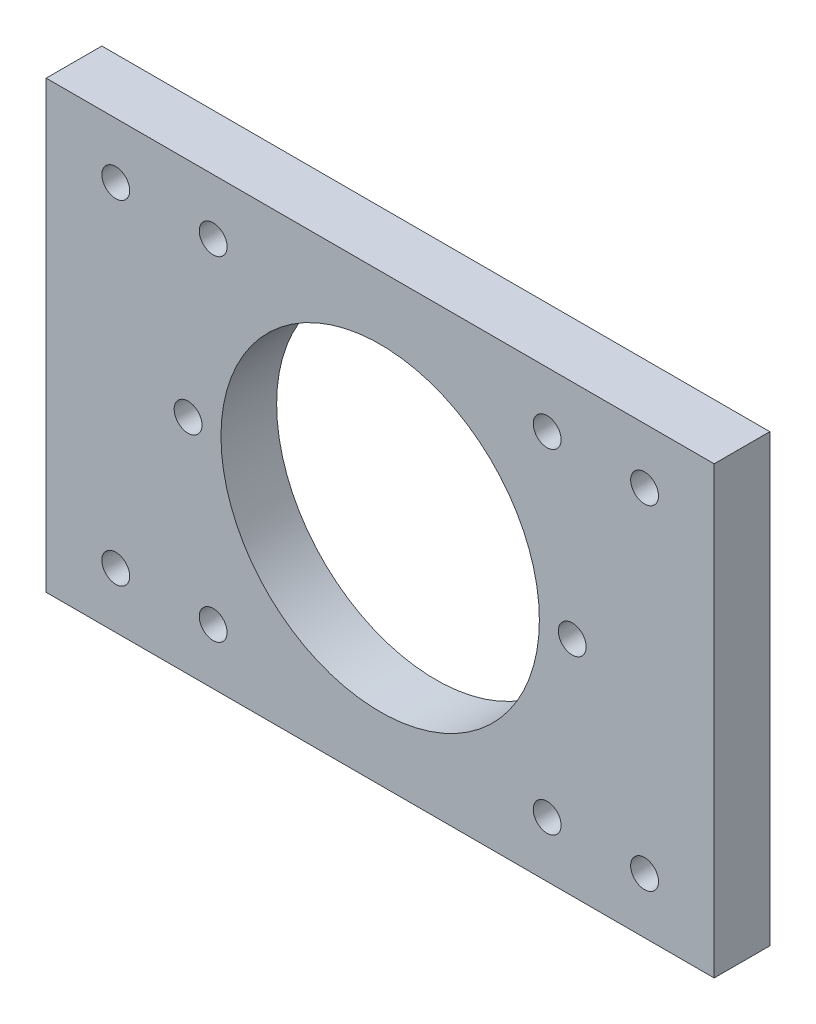
ISO-10303-21;
HEADER;
FILE_DESCRIPTION(('STEP AP214'),'2;1');
FILE_NAME('part.step','',(''),(''),'','','');
FILE_SCHEMA(('AUTOMOTIVE_DESIGN { 1 0 10303 214 1 1 1 1 }'));
ENDSEC;
DATA;
#1=APPLICATION_CONTEXT('core data for automotive mechanical design processes');
#2=APPLICATION_PROTOCOL_DEFINITION('international standard','automotive_design',2000,#1);
#3=PRODUCT_CONTEXT('',#1,'mechanical');
#4=PRODUCT('Part','Part','',(#3));
#5=PRODUCT_RELATED_PRODUCT_CATEGORY('part','',(#4));
#6=PRODUCT_DEFINITION_FORMATION('','',#4);
#7=PRODUCT_DEFINITION_CONTEXT('part definition',#1,'design');
#8=PRODUCT_DEFINITION('design','',#6,#7);
#9=PRODUCT_DEFINITION_SHAPE('','',#8);
#10=(LENGTH_UNIT() NAMED_UNIT(*) SI_UNIT(.MILLI.,.METRE.));
#11=(NAMED_UNIT(*) PLANE_ANGLE_UNIT() SI_UNIT($,.RADIAN.));
#12=(NAMED_UNIT(*) SI_UNIT($,.STERADIAN.) SOLID_ANGLE_UNIT());
#13=UNCERTAINTY_MEASURE_WITH_UNIT(LENGTH_MEASURE(1.E-05),#10,'distance_accuracy_value','');
#14=(GEOMETRIC_REPRESENTATION_CONTEXT(3) GLOBAL_UNCERTAINTY_ASSIGNED_CONTEXT((#13)) GLOBAL_UNIT_ASSIGNED_CONTEXT((#10,
#11,#12)) REPRESENTATION_CONTEXT('',''));
#15=CARTESIAN_POINT('',(0.,0.,0.));
#16=DIRECTION('',(0.,0.,1.));
#17=DIRECTION('',(1.,0.,0.));
#18=AXIS2_PLACEMENT_3D('',#15,#16,#17);
#19=CARTESIAN_POINT('',(0.,50.8,6.35));
#20=DIRECTION('',(0.,0.,-1.));
#21=DIRECTION('',(-1.,0.,0.));
#22=AXIS2_PLACEMENT_3D('',#19,#20,#21);
#23=PLANE('',#22);
#24=CARTESIAN_POINT('',(19.0500000000001,6.35000000000006,6.35));
#25=DIRECTION('',(0.,0.,-1.));
#26=DIRECTION('',(-1.,0.,0.));
#27=AXIS2_PLACEMENT_3D('',#24,#25,#26);
#28=CIRCLE('',#27,1.5875);
#29=CARTESIAN_POINT('',(17.4625000000001,6.35000000000006,6.35));
#30=VERTEX_POINT('',#29);
#31=EDGE_CURVE('E344',#30,#30,#28,.T.);
#32=ORIENTED_EDGE('',*,*,#31,.T.);
#33=EDGE_LOOP('',(#32));
#34=FACE_BOUND('',#33,.T.);
#35=CARTESIAN_POINT('',(57.1499999999999,6.34999999999994,6.35));
#36=DIRECTION('',(0.,0.,-1.));
#37=DIRECTION('',(-1.,0.,0.));
#38=AXIS2_PLACEMENT_3D('',#35,#36,#37);
#39=CIRCLE('',#38,1.5875);
#40=CARTESIAN_POINT('',(55.5624999999999,6.34999999999994,6.35));
#41=VERTEX_POINT('',#40);
#42=EDGE_CURVE('E352',#41,#41,#39,.T.);
#43=ORIENTED_EDGE('',*,*,#42,.T.);
#44=EDGE_LOOP('',(#43));
#45=FACE_BOUND('',#44,.T.);
#46=CARTESIAN_POINT('',(57.1499999999993,44.4499999999998,6.35));
#47=DIRECTION('',(0.,0.,-1.));
#48=DIRECTION('',(-1.,0.,0.));
#49=AXIS2_PLACEMENT_3D('',#46,#47,#48);
#50=CIRCLE('',#49,1.5875);
#51=CARTESIAN_POINT('',(55.5624999999993,44.4499999999998,6.35));
#52=VERTEX_POINT('',#51);
#53=EDGE_CURVE('E358',#52,#52,#50,.T.);
#54=ORIENTED_EDGE('',*,*,#53,.T.);
#55=EDGE_LOOP('',(#54));
#56=FACE_BOUND('',#55,.T.);
#57=CARTESIAN_POINT('',(19.0499999999999,44.45,6.35));
#58=DIRECTION('',(0.,0.,-1.));
#59=DIRECTION('',(-1.,0.,0.));
#60=AXIS2_PLACEMENT_3D('',#57,#58,#59);
#61=CIRCLE('',#60,1.5875);
#62=CARTESIAN_POINT('',(17.4624999999999,44.45,6.35));
#63=VERTEX_POINT('',#62);
#64=EDGE_CURVE('E135',#63,#63,#61,.T.);
#65=ORIENTED_EDGE('',*,*,#64,.T.);
#66=EDGE_LOOP('',(#65));
#67=FACE_BOUND('',#66,.T.);
#68=CARTESIAN_POINT('',(7.93750000000001,44.45,6.35));
#69=DIRECTION('',(0.,0.,1.));
#70=DIRECTION('',(1.,0.,0.));
#71=AXIS2_PLACEMENT_3D('',#68,#69,#70);
#72=CIRCLE('',#71,1.5875);
#73=CARTESIAN_POINT('',(9.52500000000001,44.45,6.35));
#74=VERTEX_POINT('',#73);
#75=EDGE_CURVE('E149',#74,#74,#72,.T.);
#76=ORIENTED_EDGE('',*,*,#75,.F.);
#77=EDGE_LOOP('',(#76));
#78=FACE_BOUND('',#77,.T.);
#79=CARTESIAN_POINT('',(68.2625,44.45,6.35));
#80=DIRECTION('',(0.,0.,-1.));
#81=DIRECTION('',(-1.,0.,0.));
#82=AXIS2_PLACEMENT_3D('',#79,#80,#81);
#83=CIRCLE('',#82,1.5875);
#84=CARTESIAN_POINT('',(66.675,44.45,6.35));
#85=VERTEX_POINT('',#84);
#86=EDGE_CURVE('E155',#85,#85,#83,.T.);
#87=ORIENTED_EDGE('',*,*,#86,.T.);
#88=EDGE_LOOP('',(#87));
#89=FACE_BOUND('',#88,.T.);
#90=CARTESIAN_POINT('',(16.1881750645913,25.4,6.35));
#91=DIRECTION('',(0.,0.,-1.));
#92=DIRECTION('',(-1.,0.,0.));
#93=AXIS2_PLACEMENT_3D('',#90,#91,#92);
#94=CIRCLE('',#93,1.5875);
#95=CARTESIAN_POINT('',(14.6006750645913,25.4,6.35));
#96=VERTEX_POINT('',#95);
#97=EDGE_CURVE('E165',#96,#96,#94,.F.);
#98=ORIENTED_EDGE('',*,*,#97,.F.);
#99=EDGE_LOOP('',(#98));
#100=FACE_BOUND('',#99,.T.);
#101=DIRECTION('',(0.,-1.,0.));
#102=VECTOR('',#101,1.);
#103=CARTESIAN_POINT('',(0.,0.,6.35));
#104=LINE('',#103,#102);
#105=CARTESIAN_POINT('',(0.,50.8,6.35));
#106=VERTEX_POINT('',#105);
#107=CARTESIAN_POINT('',(0.,0.,6.35));
#108=VERTEX_POINT('',#107);
#109=EDGE_CURVE('E88',#106,#108,#104,.T.);
#110=ORIENTED_EDGE('',*,*,#109,.T.);
#111=DIRECTION('',(1.,0.,0.));
#112=VECTOR('',#111,1.);
#113=CARTESIAN_POINT('',(0.,0.,6.35));
#114=LINE('',#113,#112);
#115=CARTESIAN_POINT('',(76.2,0.,6.35));
#116=VERTEX_POINT('',#115);
#117=EDGE_CURVE('E83',#108,#116,#114,.T.);
#118=ORIENTED_EDGE('',*,*,#117,.T.);
#119=DIRECTION('',(0.,1.,0.));
#120=VECTOR('',#119,1.);
#121=CARTESIAN_POINT('',(76.2,0.,6.35));
#122=LINE('',#121,#120);
#123=CARTESIAN_POINT('',(76.2,50.8,6.35));
#124=VERTEX_POINT('',#123);
#125=EDGE_CURVE('E86',#116,#124,#122,.T.);
#126=ORIENTED_EDGE('',*,*,#125,.T.);
#127=DIRECTION('',(-1.,0.,0.));
#128=VECTOR('',#127,1.);
#129=CARTESIAN_POINT('',(0.,50.8,6.35));
#130=LINE('',#129,#128);
#131=EDGE_CURVE('E52',#124,#106,#130,.T.);
#132=ORIENTED_EDGE('',*,*,#131,.T.);
#133=EDGE_LOOP('',(#110,#118,#126,#132));
#134=FACE_BOUND('',#133,.T.);
#135=CARTESIAN_POINT('',(38.1,25.4,6.35));
#136=DIRECTION('',(0.,0.,-1.));
#137=DIRECTION('',(-1.,0.,0.));
#138=AXIS2_PLACEMENT_3D('',#135,#136,#137);
#139=CIRCLE('',#138,18.161);
#140=CARTESIAN_POINT('',(19.939,25.4,6.35));
#141=VERTEX_POINT('',#140);
#142=EDGE_CURVE('E162',#141,#141,#139,.F.);
#143=ORIENTED_EDGE('',*,*,#142,.F.);
#144=EDGE_LOOP('',(#143));
#145=FACE_BOUND('',#144,.T.);
#146=CARTESIAN_POINT('',(60.0118249354087,25.4,6.35));
#147=DIRECTION('',(0.,0.,-1.));
#148=DIRECTION('',(-1.,0.,0.));
#149=AXIS2_PLACEMENT_3D('',#146,#147,#148);
#150=CIRCLE('',#149,1.5875);
#151=CARTESIAN_POINT('',(58.4243249354087,25.4,6.35));
#152=VERTEX_POINT('',#151);
#153=EDGE_CURVE('E105',#152,#152,#150,.F.);
#154=ORIENTED_EDGE('',*,*,#153,.F.);
#155=EDGE_LOOP('',(#154));
#156=FACE_BOUND('',#155,.T.);
#157=CARTESIAN_POINT('',(7.9375,6.35,6.35));
#158=DIRECTION('',(0.,0.,-1.));
#159=DIRECTION('',(1.,0.,0.));
#160=AXIS2_PLACEMENT_3D('',#157,#158,#159);
#161=CIRCLE('',#160,1.5875);
#162=CARTESIAN_POINT('',(9.525,6.35,6.35));
#163=VERTEX_POINT('',#162);
#164=EDGE_CURVE('E144',#163,#163,#161,.T.);
#165=ORIENTED_EDGE('',*,*,#164,.T.);
#166=EDGE_LOOP('',(#165));
#167=FACE_BOUND('',#166,.T.);
#168=CARTESIAN_POINT('',(68.2625,6.35,6.35));
#169=DIRECTION('',(0.,0.,1.));
#170=DIRECTION('',(-1.,0.,0.));
#171=AXIS2_PLACEMENT_3D('',#168,#169,#170);
#172=CIRCLE('',#171,1.5875);
#173=CARTESIAN_POINT('',(66.675,6.35,6.35));
#174=VERTEX_POINT('',#173);
#175=EDGE_CURVE('E134',#174,#174,#172,.T.);
#176=ORIENTED_EDGE('',*,*,#175,.F.);
#177=EDGE_LOOP('',(#176));
#178=FACE_BOUND('',#177,.T.);
#179=ADVANCED_FACE('F35',(#34,#45,#56,#67,#78,#89,#100,#134,#145,#156,#167,#178),#23,.F.);
#180=CARTESIAN_POINT('',(0.,50.8,0.));
#181=DIRECTION('',(0.,0.,-1.));
#182=DIRECTION('',(-1.,0.,0.));
#183=AXIS2_PLACEMENT_3D('',#180,#181,#182);
#184=PLANE('',#183);
#185=CARTESIAN_POINT('',(19.0500000000001,6.35000000000006,0.));
#186=DIRECTION('',(0.,0.,-1.));
#187=DIRECTION('',(-1.,0.,0.));
#188=AXIS2_PLACEMENT_3D('',#185,#186,#187);
#189=CIRCLE('',#188,1.5875);
#190=CARTESIAN_POINT('',(17.4625000000001,6.35000000000006,0.));
#191=VERTEX_POINT('',#190);
#192=EDGE_CURVE('E347',#191,#191,#189,.T.);
#193=ORIENTED_EDGE('',*,*,#192,.F.);
#194=EDGE_LOOP('',(#193));
#195=FACE_BOUND('',#194,.T.);
#196=CARTESIAN_POINT('',(57.1499999999999,6.34999999999994,0.));
#197=DIRECTION('',(0.,0.,-1.));
#198=DIRECTION('',(-1.,0.,0.));
#199=AXIS2_PLACEMENT_3D('',#196,#197,#198);
#200=CIRCLE('',#199,1.5875);
#201=CARTESIAN_POINT('',(55.5624999999999,6.34999999999994,0.));
#202=VERTEX_POINT('',#201);
#203=EDGE_CURVE('E349',#202,#202,#200,.T.);
#204=ORIENTED_EDGE('',*,*,#203,.F.);
#205=EDGE_LOOP('',(#204));
#206=FACE_BOUND('',#205,.T.);
#207=CARTESIAN_POINT('',(57.1499999999993,44.4499999999998,0.));
#208=DIRECTION('',(0.,0.,-1.));
#209=DIRECTION('',(-1.,0.,0.));
#210=AXIS2_PLACEMENT_3D('',#207,#208,#209);
#211=CIRCLE('',#210,1.5875);
#212=CARTESIAN_POINT('',(55.5624999999993,44.4499999999998,0.));
#213=VERTEX_POINT('',#212);
#214=EDGE_CURVE('E355',#213,#213,#211,.T.);
#215=ORIENTED_EDGE('',*,*,#214,.F.);
#216=EDGE_LOOP('',(#215));
#217=FACE_BOUND('',#216,.T.);
#218=CARTESIAN_POINT('',(19.0499999999999,44.45,0.));
#219=DIRECTION('',(0.,0.,-1.));
#220=DIRECTION('',(-1.,0.,0.));
#221=AXIS2_PLACEMENT_3D('',#218,#219,#220);
#222=CIRCLE('',#221,1.5875);
#223=CARTESIAN_POINT('',(17.4624999999999,44.45,0.));
#224=VERTEX_POINT('',#223);
#225=EDGE_CURVE('E140',#224,#224,#222,.T.);
#226=ORIENTED_EDGE('',*,*,#225,.F.);
#227=EDGE_LOOP('',(#226));
#228=FACE_BOUND('',#227,.T.);
#229=CARTESIAN_POINT('',(7.93750000000001,44.45,0.));
#230=DIRECTION('',(0.,0.,1.));
#231=DIRECTION('',(1.,0.,0.));
#232=AXIS2_PLACEMENT_3D('',#229,#230,#231);
#233=CIRCLE('',#232,1.5875);
#234=CARTESIAN_POINT('',(9.52500000000001,44.45,0.));
#235=VERTEX_POINT('',#234);
#236=EDGE_CURVE('E147',#235,#235,#233,.T.);
#237=ORIENTED_EDGE('',*,*,#236,.T.);
#238=EDGE_LOOP('',(#237));
#239=FACE_BOUND('',#238,.T.);
#240=CARTESIAN_POINT('',(68.2625,44.45,0.));
#241=DIRECTION('',(0.,0.,-1.));
#242=DIRECTION('',(-1.,0.,0.));
#243=AXIS2_PLACEMENT_3D('',#240,#241,#242);
#244=CIRCLE('',#243,1.5875);
#245=CARTESIAN_POINT('',(66.675,44.45,0.));
#246=VERTEX_POINT('',#245);
#247=EDGE_CURVE('E152',#246,#246,#244,.T.);
#248=ORIENTED_EDGE('',*,*,#247,.F.);
#249=EDGE_LOOP('',(#248));
#250=FACE_BOUND('',#249,.T.);
#251=CARTESIAN_POINT('',(38.1,25.4,0.));
#252=DIRECTION('',(0.,0.,-1.));
#253=DIRECTION('',(-1.,0.,0.));
#254=AXIS2_PLACEMENT_3D('',#251,#252,#253);
#255=CIRCLE('',#254,18.161);
#256=CARTESIAN_POINT('',(19.939,25.4,0.));
#257=VERTEX_POINT('',#256);
#258=EDGE_CURVE('E11',#257,#257,#255,.F.);
#259=ORIENTED_EDGE('',*,*,#258,.T.);
#260=EDGE_LOOP('',(#259));
#261=FACE_BOUND('',#260,.T.);
#262=DIRECTION('',(0.,-1.,0.));
#263=VECTOR('',#262,1.);
#264=CARTESIAN_POINT('',(0.,0.,0.));
#265=LINE('',#264,#263);
#266=CARTESIAN_POINT('',(0.,50.8,0.));
#267=VERTEX_POINT('',#266);
#268=CARTESIAN_POINT('',(0.,0.,0.));
#269=VERTEX_POINT('',#268);
#270=EDGE_CURVE('E102',#267,#269,#265,.T.);
#271=ORIENTED_EDGE('',*,*,#270,.F.);
#272=DIRECTION('',(-1.,0.,0.));
#273=VECTOR('',#272,1.);
#274=CARTESIAN_POINT('',(0.,50.8,0.));
#275=LINE('',#274,#273);
#276=CARTESIAN_POINT('',(76.2,50.8,0.));
#277=VERTEX_POINT('',#276);
#278=EDGE_CURVE('E75',#277,#267,#275,.T.);
#279=ORIENTED_EDGE('',*,*,#278,.F.);
#280=DIRECTION('',(0.,1.,0.));
#281=VECTOR('',#280,1.);
#282=CARTESIAN_POINT('',(76.2,0.,0.));
#283=LINE('',#282,#281);
#284=CARTESIAN_POINT('',(76.2,0.,0.));
#285=VERTEX_POINT('',#284);
#286=EDGE_CURVE('E69',#285,#277,#283,.T.);
#287=ORIENTED_EDGE('',*,*,#286,.F.);
#288=DIRECTION('',(1.,0.,0.));
#289=VECTOR('',#288,1.);
#290=CARTESIAN_POINT('',(0.,0.,0.));
#291=LINE('',#290,#289);
#292=EDGE_CURVE('E93',#269,#285,#291,.T.);
#293=ORIENTED_EDGE('',*,*,#292,.F.);
#294=EDGE_LOOP('',(#271,#279,#287,#293));
#295=FACE_BOUND('',#294,.T.);
#296=CARTESIAN_POINT('',(60.0118249354087,25.4,0.));
#297=DIRECTION('',(0.,0.,1.));
#298=DIRECTION('',(0.707106781186548,-0.707106781186548,0.));
#299=AXIS2_PLACEMENT_3D('',#296,#297,#298);
#300=CIRCLE('',#299,1.5875);
#301=CARTESIAN_POINT('',(61.1343569505423,24.2774679848664,0.));
#302=VERTEX_POINT('',#301);
#303=EDGE_CURVE('E121',#302,#302,#300,.T.);
#304=ORIENTED_EDGE('',*,*,#303,.T.);
#305=EDGE_LOOP('',(#304));
#306=FACE_BOUND('',#305,.T.);
#307=CARTESIAN_POINT('',(16.1881750645913,25.4,0.));
#308=DIRECTION('',(0.,0.,1.));
#309=DIRECTION('',(0.707106781186548,-0.707106781186548,0.));
#310=AXIS2_PLACEMENT_3D('',#307,#308,#309);
#311=CIRCLE('',#310,1.5875);
#312=CARTESIAN_POINT('',(17.3107070797249,24.2774679848663,0.));
#313=VERTEX_POINT('',#312);
#314=EDGE_CURVE('E125',#313,#313,#311,.T.);
#315=ORIENTED_EDGE('',*,*,#314,.T.);
#316=EDGE_LOOP('',(#315));
#317=FACE_BOUND('',#316,.T.);
#318=CARTESIAN_POINT('',(7.9375,6.35,0.));
#319=DIRECTION('',(0.,0.,-1.));
#320=DIRECTION('',(1.,0.,0.));
#321=AXIS2_PLACEMENT_3D('',#318,#319,#320);
#322=CIRCLE('',#321,1.5875);
#323=CARTESIAN_POINT('',(9.525,6.35,0.));
#324=VERTEX_POINT('',#323);
#325=EDGE_CURVE('E129',#324,#324,#322,.T.);
#326=ORIENTED_EDGE('',*,*,#325,.F.);
#327=EDGE_LOOP('',(#326));
#328=FACE_BOUND('',#327,.T.);
#329=CARTESIAN_POINT('',(68.2625,6.35,0.));
#330=DIRECTION('',(0.,0.,1.));
#331=DIRECTION('',(-1.,0.,0.));
#332=AXIS2_PLACEMENT_3D('',#329,#330,#331);
#333=CIRCLE('',#332,1.5875);
#334=CARTESIAN_POINT('',(66.675,6.35,0.));
#335=VERTEX_POINT('',#334);
#336=EDGE_CURVE('E132',#335,#335,#333,.T.);
#337=ORIENTED_EDGE('',*,*,#336,.T.);
#338=EDGE_LOOP('',(#337));
#339=FACE_BOUND('',#338,.T.);
#340=ADVANCED_FACE('F113',(#195,#206,#217,#228,#239,#250,#261,#295,#306,#317,#328,#339),#184,.T.);
#341=CARTESIAN_POINT('',(0.,0.,6.35));
#342=DIRECTION('',(1.,0.,0.));
#343=DIRECTION('',(0.,1.,0.));
#344=AXIS2_PLACEMENT_3D('',#341,#342,#343);
#345=PLANE('',#344);
#346=ORIENTED_EDGE('',*,*,#270,.T.);
#347=DIRECTION('',(0.,0.,-1.));
#348=VECTOR('',#347,1.);
#349=CARTESIAN_POINT('',(0.,0.,6.35));
#350=LINE('',#349,#348);
#351=EDGE_CURVE('E44',#108,#269,#350,.T.);
#352=ORIENTED_EDGE('',*,*,#351,.F.);
#353=ORIENTED_EDGE('',*,*,#109,.F.);
#354=DIRECTION('',(0.,0.,-1.));
#355=VECTOR('',#354,1.);
#356=CARTESIAN_POINT('',(0.,50.8,6.35));
#357=LINE('',#356,#355);
#358=EDGE_CURVE('E98',#106,#267,#357,.T.);
#359=ORIENTED_EDGE('',*,*,#358,.T.);
#360=EDGE_LOOP('',(#346,#352,#353,#359));
#361=FACE_BOUND('',#360,.T.);
#362=ADVANCED_FACE('F37',(#361),#345,.F.);
#363=CARTESIAN_POINT('',(0.,0.,6.35));
#364=DIRECTION('',(0.,1.,0.));
#365=DIRECTION('',(0.,0.,1.));
#366=AXIS2_PLACEMENT_3D('',#363,#364,#365);
#367=PLANE('',#366);
#368=ORIENTED_EDGE('',*,*,#292,.T.);
#369=DIRECTION('',(0.,0.,-1.));
#370=VECTOR('',#369,1.);
#371=CARTESIAN_POINT('',(76.2,0.,6.35));
#372=LINE('',#371,#370);
#373=EDGE_CURVE('E91',#116,#285,#372,.T.);
#374=ORIENTED_EDGE('',*,*,#373,.F.);
#375=ORIENTED_EDGE('',*,*,#117,.F.);
#376=ORIENTED_EDGE('',*,*,#351,.T.);
#377=EDGE_LOOP('',(#368,#374,#375,#376));
#378=FACE_BOUND('',#377,.T.);
#379=ADVANCED_FACE('F92',(#378),#367,.F.);
#380=CARTESIAN_POINT('',(76.2,0.,6.35));
#381=DIRECTION('',(-1.,0.,0.));
#382=DIRECTION('',(0.,-1.,0.));
#383=AXIS2_PLACEMENT_3D('',#380,#381,#382);
#384=PLANE('',#383);
#385=ORIENTED_EDGE('',*,*,#286,.T.);
#386=DIRECTION('',(0.,0.,-1.));
#387=VECTOR('',#386,1.);
#388=CARTESIAN_POINT('',(76.2,50.8,6.35));
#389=LINE('',#388,#387);
#390=EDGE_CURVE('E94',#124,#277,#389,.T.);
#391=ORIENTED_EDGE('',*,*,#390,.F.);
#392=ORIENTED_EDGE('',*,*,#125,.F.);
#393=ORIENTED_EDGE('',*,*,#373,.T.);
#394=EDGE_LOOP('',(#385,#391,#392,#393));
#395=FACE_BOUND('',#394,.T.);
#396=ADVANCED_FACE('F96',(#395),#384,.F.);
#397=CARTESIAN_POINT('',(0.,50.8,6.35));
#398=DIRECTION('',(0.,-1.,0.));
#399=DIRECTION('',(0.,0.,-1.));
#400=AXIS2_PLACEMENT_3D('',#397,#398,#399);
#401=PLANE('',#400);
#402=ORIENTED_EDGE('',*,*,#278,.T.);
#403=ORIENTED_EDGE('',*,*,#358,.F.);
#404=ORIENTED_EDGE('',*,*,#131,.F.);
#405=ORIENTED_EDGE('',*,*,#390,.T.);
#406=EDGE_LOOP('',(#402,#403,#404,#405));
#407=FACE_BOUND('',#406,.T.);
#408=ADVANCED_FACE('F209',(#407),#401,.F.);
#409=CARTESIAN_POINT('',(38.1,25.4,-2.54));
#410=DIRECTION('',(0.,0.,1.));
#411=DIRECTION('',(0.707106781186548,-0.707106781186548,0.));
#412=AXIS2_PLACEMENT_3D('',#409,#410,#411);
#413=CYLINDRICAL_SURFACE('',#412,18.161);
#414=ORIENTED_EDGE('',*,*,#258,.F.);
#415=EDGE_LOOP('',(#414));
#416=FACE_BOUND('',#415,.T.);
#417=ORIENTED_EDGE('',*,*,#142,.T.);
#418=EDGE_LOOP('',(#417));
#419=FACE_BOUND('',#418,.T.);
#420=ADVANCED_FACE('F205',(#416,#419),#413,.F.);
#421=CARTESIAN_POINT('',(16.1881750645913,25.4,25.4));
#422=DIRECTION('',(0.,0.,-1.));
#423=DIRECTION('',(-0.707106781186548,0.707106781186548,0.));
#424=AXIS2_PLACEMENT_3D('',#421,#422,#423);
#425=CYLINDRICAL_SURFACE('',#424,1.5875);
#426=ORIENTED_EDGE('',*,*,#314,.F.);
#427=EDGE_LOOP('',(#426));
#428=FACE_BOUND('',#427,.T.);
#429=ORIENTED_EDGE('',*,*,#97,.T.);
#430=EDGE_LOOP('',(#429));
#431=FACE_BOUND('',#430,.T.);
#432=ADVANCED_FACE('F208',(#428,#431),#425,.F.);
#433=CARTESIAN_POINT('',(60.0118249354087,25.4,25.4));
#434=DIRECTION('',(0.,0.,-1.));
#435=DIRECTION('',(-0.707106781186548,0.707106781186548,0.));
#436=AXIS2_PLACEMENT_3D('',#433,#434,#435);
#437=CYLINDRICAL_SURFACE('',#436,1.5875);
#438=ORIENTED_EDGE('',*,*,#303,.F.);
#439=EDGE_LOOP('',(#438));
#440=FACE_BOUND('',#439,.T.);
#441=ORIENTED_EDGE('',*,*,#153,.T.);
#442=EDGE_LOOP('',(#441));
#443=FACE_BOUND('',#442,.T.);
#444=ADVANCED_FACE('F171',(#440,#443),#437,.F.);
#445=CARTESIAN_POINT('',(68.2625,44.45,6.35));
#446=DIRECTION('',(0.,0.,-1.));
#447=DIRECTION('',(-1.,0.,0.));
#448=AXIS2_PLACEMENT_3D('',#445,#446,#447);
#449=CYLINDRICAL_SURFACE('',#448,1.5875);
#450=ORIENTED_EDGE('',*,*,#86,.F.);
#451=EDGE_LOOP('',(#450));
#452=FACE_BOUND('',#451,.T.);
#453=ORIENTED_EDGE('',*,*,#247,.T.);
#454=EDGE_LOOP('',(#453));
#455=FACE_BOUND('',#454,.T.);
#456=ADVANCED_FACE('F200',(#452,#455),#449,.F.);
#457=CARTESIAN_POINT('',(7.93750000000001,44.45,6.35));
#458=DIRECTION('',(0.,0.,-1.));
#459=DIRECTION('',(-1.,0.,0.));
#460=AXIS2_PLACEMENT_3D('',#457,#458,#459);
#461=CYLINDRICAL_SURFACE('',#460,1.5875);
#462=ORIENTED_EDGE('',*,*,#75,.T.);
#463=EDGE_LOOP('',(#462));
#464=FACE_BOUND('',#463,.T.);
#465=ORIENTED_EDGE('',*,*,#236,.F.);
#466=EDGE_LOOP('',(#465));
#467=FACE_BOUND('',#466,.T.);
#468=ADVANCED_FACE('F193',(#464,#467),#461,.F.);
#469=CARTESIAN_POINT('',(7.9375,6.35,6.35));
#470=DIRECTION('',(0.,0.,-1.));
#471=DIRECTION('',(-1.,0.,0.));
#472=AXIS2_PLACEMENT_3D('',#469,#470,#471);
#473=CYLINDRICAL_SURFACE('',#472,1.5875);
#474=ORIENTED_EDGE('',*,*,#164,.F.);
#475=EDGE_LOOP('',(#474));
#476=FACE_BOUND('',#475,.T.);
#477=ORIENTED_EDGE('',*,*,#325,.T.);
#478=EDGE_LOOP('',(#477));
#479=FACE_BOUND('',#478,.T.);
#480=ADVANCED_FACE('F184',(#476,#479),#473,.F.);
#481=CARTESIAN_POINT('',(68.2625,6.35,6.35));
#482=DIRECTION('',(0.,0.,-1.));
#483=DIRECTION('',(-1.,0.,0.));
#484=AXIS2_PLACEMENT_3D('',#481,#482,#483);
#485=CYLINDRICAL_SURFACE('',#484,1.5875);
#486=ORIENTED_EDGE('',*,*,#175,.T.);
#487=EDGE_LOOP('',(#486));
#488=FACE_BOUND('',#487,.T.);
#489=ORIENTED_EDGE('',*,*,#336,.F.);
#490=EDGE_LOOP('',(#489));
#491=FACE_BOUND('',#490,.T.);
#492=ADVANCED_FACE('F181',(#488,#491),#485,.F.);
#493=CARTESIAN_POINT('',(19.0499999999999,44.45,6.35));
#494=DIRECTION('',(0.,0.,-1.));
#495=DIRECTION('',(-1.,0.,0.));
#496=AXIS2_PLACEMENT_3D('',#493,#494,#495);
#497=CYLINDRICAL_SURFACE('',#496,1.5875);
#498=ORIENTED_EDGE('',*,*,#64,.F.);
#499=EDGE_LOOP('',(#498));
#500=FACE_BOUND('',#499,.T.);
#501=ORIENTED_EDGE('',*,*,#225,.T.);
#502=EDGE_LOOP('',(#501));
#503=FACE_BOUND('',#502,.T.);
#504=ADVANCED_FACE('F183',(#500,#503),#497,.F.);
#505=CARTESIAN_POINT('',(57.1499999999993,44.4499999999998,6.35));
#506=DIRECTION('',(0.,0.,-1.));
#507=DIRECTION('',(-1.,0.,0.));
#508=AXIS2_PLACEMENT_3D('',#505,#506,#507);
#509=CYLINDRICAL_SURFACE('',#508,1.5875);
#510=ORIENTED_EDGE('',*,*,#53,.F.);
#511=EDGE_LOOP('',(#510));
#512=FACE_BOUND('',#511,.T.);
#513=ORIENTED_EDGE('',*,*,#214,.T.);
#514=EDGE_LOOP('',(#513));
#515=FACE_BOUND('',#514,.T.);
#516=ADVANCED_FACE('F190',(#512,#515),#509,.F.);
#517=CARTESIAN_POINT('',(57.1499999999999,6.34999999999994,6.35));
#518=DIRECTION('',(0.,0.,-1.));
#519=DIRECTION('',(-1.,0.,0.));
#520=AXIS2_PLACEMENT_3D('',#517,#518,#519);
#521=CYLINDRICAL_SURFACE('',#520,1.5875);
#522=ORIENTED_EDGE('',*,*,#42,.F.);
#523=EDGE_LOOP('',(#522));
#524=FACE_BOUND('',#523,.T.);
#525=ORIENTED_EDGE('',*,*,#203,.T.);
#526=EDGE_LOOP('',(#525));
#527=FACE_BOUND('',#526,.T.);
#528=ADVANCED_FACE('F318',(#524,#527),#521,.F.);
#529=CARTESIAN_POINT('',(19.0500000000001,6.35000000000006,6.35));
#530=DIRECTION('',(0.,0.,-1.));
#531=DIRECTION('',(-1.,0.,0.));
#532=AXIS2_PLACEMENT_3D('',#529,#530,#531);
#533=CYLINDRICAL_SURFACE('',#532,1.5875);
#534=ORIENTED_EDGE('',*,*,#31,.F.);
#535=EDGE_LOOP('',(#534));
#536=FACE_BOUND('',#535,.T.);
#537=ORIENTED_EDGE('',*,*,#192,.T.);
#538=EDGE_LOOP('',(#537));
#539=FACE_BOUND('',#538,.T.);
#540=ADVANCED_FACE('F326',(#536,#539),#533,.F.);
#541=CLOSED_SHELL('',(#179,#340,#362,#379,#396,#408,#420,#432,#444,#456,#468,#480,#492,#504,
#516,#528,#540));
#542=MANIFOLD_SOLID_BREP('B2',#541);
#543=ADVANCED_BREP_SHAPE_REPRESENTATION('',(#18,#542),#14);
#544=SHAPE_DEFINITION_REPRESENTATION(#9,#543);
ENDSEC;
END-ISO-10303-21;
